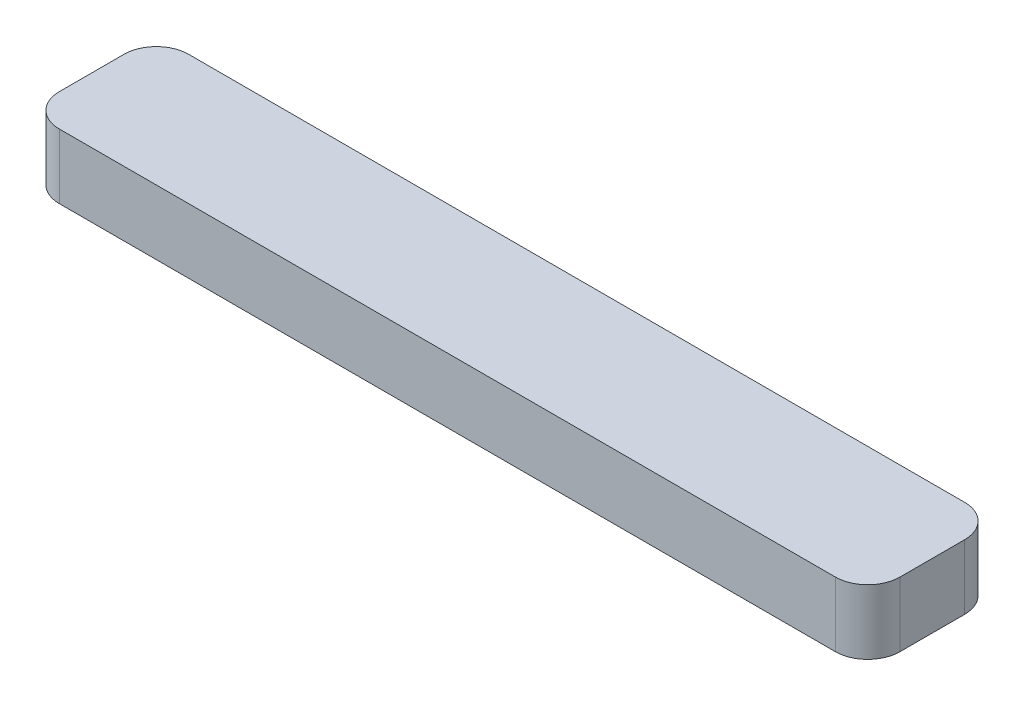
ISO-10303-21;
HEADER;
FILE_DESCRIPTION(('STEP AP214'),'2;1');
FILE_NAME('part.step','',(''),(''),'','','');
FILE_SCHEMA(('AUTOMOTIVE_DESIGN { 1 0 10303 214 1 1 1 1 }'));
ENDSEC;
DATA;
#1=APPLICATION_CONTEXT('core data for automotive mechanical design processes');
#2=APPLICATION_PROTOCOL_DEFINITION('international standard','automotive_design',2000,#1);
#3=PRODUCT_CONTEXT('',#1,'mechanical');
#4=PRODUCT('Part','Part','',(#3));
#5=PRODUCT_RELATED_PRODUCT_CATEGORY('part','',(#4));
#6=PRODUCT_DEFINITION_FORMATION('','',#4);
#7=PRODUCT_DEFINITION_CONTEXT('part definition',#1,'design');
#8=PRODUCT_DEFINITION('design','',#6,#7);
#9=PRODUCT_DEFINITION_SHAPE('','',#8);
#10=(LENGTH_UNIT() NAMED_UNIT(*) SI_UNIT(.MILLI.,.METRE.));
#11=(NAMED_UNIT(*) PLANE_ANGLE_UNIT() SI_UNIT($,.RADIAN.));
#12=(NAMED_UNIT(*) SI_UNIT($,.STERADIAN.) SOLID_ANGLE_UNIT());
#13=UNCERTAINTY_MEASURE_WITH_UNIT(LENGTH_MEASURE(1.E-05),#10,'distance_accuracy_value','');
#14=(GEOMETRIC_REPRESENTATION_CONTEXT(3) GLOBAL_UNCERTAINTY_ASSIGNED_CONTEXT((#13)) GLOBAL_UNIT_ASSIGNED_CONTEXT((#10,
#11,#12)) REPRESENTATION_CONTEXT('',''));
#15=CARTESIAN_POINT('',(0.,0.,0.));
#16=DIRECTION('',(0.,0.,1.));
#17=DIRECTION('',(1.,0.,0.));
#18=AXIS2_PLACEMENT_3D('',#15,#16,#17);
#19=CARTESIAN_POINT('',(6.,1.,0.5));
#20=DIRECTION('',(0.,-1.,0.));
#21=DIRECTION('',(0.,0.,-1.));
#22=AXIS2_PLACEMENT_3D('',#19,#20,#21);
#23=CYLINDRICAL_SURFACE('',#22,0.5);
#24=CARTESIAN_POINT('',(6.,0.,0.5));
#25=DIRECTION('',(0.,1.,0.));
#26=DIRECTION('',(0.,0.,1.));
#27=AXIS2_PLACEMENT_3D('',#24,#25,#26);
#28=CIRCLE('',#27,0.5);
#29=CARTESIAN_POINT('',(6.,0.,1.));
#30=VERTEX_POINT('',#29);
#31=CARTESIAN_POINT('',(6.5,0.,0.499999999999997));
#32=VERTEX_POINT('',#31);
#33=EDGE_CURVE('E146',#30,#32,#28,.T.);
#34=ORIENTED_EDGE('',*,*,#33,.T.);
#35=DIRECTION('',(0.,-1.,0.));
#36=VECTOR('',#35,1.);
#37=CARTESIAN_POINT('',(6.5,1.,0.499999999999997));
#38=LINE('',#37,#36);
#39=CARTESIAN_POINT('',(6.5,1.,0.499999999999997));
#40=VERTEX_POINT('',#39);
#41=EDGE_CURVE('E11',#40,#32,#38,.T.);
#42=ORIENTED_EDGE('',*,*,#41,.F.);
#43=CARTESIAN_POINT('',(6.,1.,0.5));
#44=DIRECTION('',(0.,1.,0.));
#45=DIRECTION('',(0.,0.,1.));
#46=AXIS2_PLACEMENT_3D('',#43,#44,#45);
#47=CIRCLE('',#46,0.5);
#48=CARTESIAN_POINT('',(6.,1.,1.));
#49=VERTEX_POINT('',#48);
#50=EDGE_CURVE('E168',#49,#40,#47,.T.);
#51=ORIENTED_EDGE('',*,*,#50,.F.);
#52=DIRECTION('',(0.,-1.,0.));
#53=VECTOR('',#52,1.);
#54=CARTESIAN_POINT('',(6.,1.,1.));
#55=LINE('',#54,#53);
#56=EDGE_CURVE('E142',#49,#30,#55,.T.);
#57=ORIENTED_EDGE('',*,*,#56,.T.);
#58=EDGE_LOOP('',(#34,#42,#51,#57));
#59=FACE_BOUND('',#58,.T.);
#60=ADVANCED_FACE('F45',(#59),#23,.T.);
#61=CARTESIAN_POINT('',(6.5,1.,-0.499999999999997));
#62=DIRECTION('',(-1.,0.,0.));
#63=DIRECTION('',(0.,0.,1.));
#64=AXIS2_PLACEMENT_3D('',#61,#62,#63);
#65=PLANE('',#64);
#66=DIRECTION('',(0.,0.,-1.));
#67=VECTOR('',#66,1.);
#68=CARTESIAN_POINT('',(6.5,0.,-0.499999999999997));
#69=LINE('',#68,#67);
#70=CARTESIAN_POINT('',(6.5,0.,-0.499999999999997));
#71=VERTEX_POINT('',#70);
#72=EDGE_CURVE('E150',#32,#71,#69,.T.);
#73=ORIENTED_EDGE('',*,*,#72,.T.);
#74=DIRECTION('',(0.,-1.,0.));
#75=VECTOR('',#74,1.);
#76=CARTESIAN_POINT('',(6.5,1.,-0.499999999999997));
#77=LINE('',#76,#75);
#78=CARTESIAN_POINT('',(6.5,1.,-0.499999999999997));
#79=VERTEX_POINT('',#78);
#80=EDGE_CURVE('E54',#79,#71,#77,.T.);
#81=ORIENTED_EDGE('',*,*,#80,.F.);
#82=DIRECTION('',(0.,0.,-1.));
#83=VECTOR('',#82,1.);
#84=CARTESIAN_POINT('',(6.5,1.,-0.499999999999997));
#85=LINE('',#84,#83);
#86=EDGE_CURVE('E105',#40,#79,#85,.T.);
#87=ORIENTED_EDGE('',*,*,#86,.F.);
#88=ORIENTED_EDGE('',*,*,#41,.T.);
#89=EDGE_LOOP('',(#73,#81,#87,#88));
#90=FACE_BOUND('',#89,.T.);
#91=ADVANCED_FACE('F214',(#90),#65,.F.);
#92=CARTESIAN_POINT('',(6.,1.,-0.5));
#93=DIRECTION('',(0.,-1.,0.));
#94=DIRECTION('',(0.,0.,-1.));
#95=AXIS2_PLACEMENT_3D('',#92,#93,#94);
#96=CYLINDRICAL_SURFACE('',#95,0.5);
#97=CARTESIAN_POINT('',(6.,0.,-0.5));
#98=DIRECTION('',(0.,1.,0.));
#99=DIRECTION('',(0.,0.,-1.));
#100=AXIS2_PLACEMENT_3D('',#97,#98,#99);
#101=CIRCLE('',#100,0.5);
#102=CARTESIAN_POINT('',(6.,0.,-1.));
#103=VERTEX_POINT('',#102);
#104=EDGE_CURVE('E153',#71,#103,#101,.T.);
#105=ORIENTED_EDGE('',*,*,#104,.T.);
#106=DIRECTION('',(0.,-1.,0.));
#107=VECTOR('',#106,1.);
#108=CARTESIAN_POINT('',(6.,1.,-1.));
#109=LINE('',#108,#107);
#110=CARTESIAN_POINT('',(6.,1.,-1.));
#111=VERTEX_POINT('',#110);
#112=EDGE_CURVE('E179',#111,#103,#109,.T.);
#113=ORIENTED_EDGE('',*,*,#112,.F.);
#114=CARTESIAN_POINT('',(6.,1.,-0.5));
#115=DIRECTION('',(0.,1.,0.));
#116=DIRECTION('',(0.,0.,-1.));
#117=AXIS2_PLACEMENT_3D('',#114,#115,#116);
#118=CIRCLE('',#117,0.5);
#119=EDGE_CURVE('E189',#79,#111,#118,.T.);
#120=ORIENTED_EDGE('',*,*,#119,.F.);
#121=ORIENTED_EDGE('',*,*,#80,.T.);
#122=EDGE_LOOP('',(#105,#113,#120,#121));
#123=FACE_BOUND('',#122,.T.);
#124=ADVANCED_FACE('F187',(#123),#96,.T.);
#125=CARTESIAN_POINT('',(-6.,1.,-1.));
#126=DIRECTION('',(0.,0.,1.));
#127=DIRECTION('',(1.,0.,0.));
#128=AXIS2_PLACEMENT_3D('',#125,#126,#127);
#129=PLANE('',#128);
#130=DIRECTION('',(-1.,0.,0.));
#131=VECTOR('',#130,1.);
#132=CARTESIAN_POINT('',(-6.,0.,-1.));
#133=LINE('',#132,#131);
#134=CARTESIAN_POINT('',(-6.,0.,-1.));
#135=VERTEX_POINT('',#134);
#136=EDGE_CURVE('E156',#103,#135,#133,.T.);
#137=ORIENTED_EDGE('',*,*,#136,.T.);
#138=DIRECTION('',(0.,-1.,0.));
#139=VECTOR('',#138,1.);
#140=CARTESIAN_POINT('',(-6.,1.,-1.));
#141=LINE('',#140,#139);
#142=CARTESIAN_POINT('',(-6.,1.,-1.));
#143=VERTEX_POINT('',#142);
#144=EDGE_CURVE('E175',#143,#135,#141,.T.);
#145=ORIENTED_EDGE('',*,*,#144,.F.);
#146=DIRECTION('',(-1.,0.,0.));
#147=VECTOR('',#146,1.);
#148=CARTESIAN_POINT('',(-6.,1.,-1.));
#149=LINE('',#148,#147);
#150=EDGE_CURVE('E202',#111,#143,#149,.T.);
#151=ORIENTED_EDGE('',*,*,#150,.F.);
#152=ORIENTED_EDGE('',*,*,#112,.T.);
#153=EDGE_LOOP('',(#137,#145,#151,#152));
#154=FACE_BOUND('',#153,.T.);
#155=ADVANCED_FACE('F197',(#154),#129,.F.);
#156=CARTESIAN_POINT('',(-6.,1.,-0.5));
#157=DIRECTION('',(0.,-1.,0.));
#158=DIRECTION('',(0.,0.,-1.));
#159=AXIS2_PLACEMENT_3D('',#156,#157,#158);
#160=CYLINDRICAL_SURFACE('',#159,0.5);
#161=CARTESIAN_POINT('',(-6.,0.,-0.5));
#162=DIRECTION('',(0.,1.,0.));
#163=DIRECTION('',(0.,0.,1.));
#164=AXIS2_PLACEMENT_3D('',#161,#162,#163);
#165=CIRCLE('',#164,0.5);
#166=CARTESIAN_POINT('',(-6.5,0.,-0.499999999999996));
#167=VERTEX_POINT('',#166);
#168=EDGE_CURVE('E159',#135,#167,#165,.T.);
#169=ORIENTED_EDGE('',*,*,#168,.T.);
#170=DIRECTION('',(0.,-1.,0.));
#171=VECTOR('',#170,1.);
#172=CARTESIAN_POINT('',(-6.5,1.,-0.499999999999996));
#173=LINE('',#172,#171);
#174=CARTESIAN_POINT('',(-6.5,1.,-0.499999999999996));
#175=VERTEX_POINT('',#174);
#176=EDGE_CURVE('E135',#175,#167,#173,.T.);
#177=ORIENTED_EDGE('',*,*,#176,.F.);
#178=CARTESIAN_POINT('',(-6.,1.,-0.5));
#179=DIRECTION('',(0.,1.,0.));
#180=DIRECTION('',(0.,0.,1.));
#181=AXIS2_PLACEMENT_3D('',#178,#179,#180);
#182=CIRCLE('',#181,0.5);
#183=EDGE_CURVE('E124',#143,#175,#182,.T.);
#184=ORIENTED_EDGE('',*,*,#183,.F.);
#185=ORIENTED_EDGE('',*,*,#144,.T.);
#186=EDGE_LOOP('',(#169,#177,#184,#185));
#187=FACE_BOUND('',#186,.T.);
#188=ADVANCED_FACE('F200',(#187),#160,.T.);
#189=CARTESIAN_POINT('',(-6.5,1.,-0.499999999999996));
#190=DIRECTION('',(1.,0.,0.));
#191=DIRECTION('',(0.,0.,-1.));
#192=AXIS2_PLACEMENT_3D('',#189,#190,#191);
#193=PLANE('',#192);
#194=DIRECTION('',(0.,0.,1.));
#195=VECTOR('',#194,1.);
#196=CARTESIAN_POINT('',(-6.5,0.,-0.499999999999996));
#197=LINE('',#196,#195);
#198=CARTESIAN_POINT('',(-6.5,0.,0.499999999999997));
#199=VERTEX_POINT('',#198);
#200=EDGE_CURVE('E133',#167,#199,#197,.T.);
#201=ORIENTED_EDGE('',*,*,#200,.T.);
#202=DIRECTION('',(0.,-1.,0.));
#203=VECTOR('',#202,1.);
#204=CARTESIAN_POINT('',(-6.5,1.,0.499999999999997));
#205=LINE('',#204,#203);
#206=CARTESIAN_POINT('',(-6.5,1.,0.499999999999997));
#207=VERTEX_POINT('',#206);
#208=EDGE_CURVE('E130',#207,#199,#205,.T.);
#209=ORIENTED_EDGE('',*,*,#208,.F.);
#210=DIRECTION('',(0.,0.,1.));
#211=VECTOR('',#210,1.);
#212=CARTESIAN_POINT('',(-6.5,1.,-0.499999999999996));
#213=LINE('',#212,#211);
#214=EDGE_CURVE('E118',#175,#207,#213,.T.);
#215=ORIENTED_EDGE('',*,*,#214,.F.);
#216=ORIENTED_EDGE('',*,*,#176,.T.);
#217=EDGE_LOOP('',(#201,#209,#215,#216));
#218=FACE_BOUND('',#217,.T.);
#219=ADVANCED_FACE('F131',(#218),#193,.F.);
#220=CARTESIAN_POINT('',(-6.,1.,0.5));
#221=DIRECTION('',(0.,-1.,0.));
#222=DIRECTION('',(0.,0.,-1.));
#223=AXIS2_PLACEMENT_3D('',#220,#221,#222);
#224=CYLINDRICAL_SURFACE('',#223,0.5);
#225=CARTESIAN_POINT('',(-6.,0.,0.5));
#226=DIRECTION('',(0.,1.,0.));
#227=DIRECTION('',(0.,0.,1.));
#228=AXIS2_PLACEMENT_3D('',#225,#226,#227);
#229=CIRCLE('',#228,0.5);
#230=CARTESIAN_POINT('',(-6.,0.,1.));
#231=VERTEX_POINT('',#230);
#232=EDGE_CURVE('E91',#199,#231,#229,.T.);
#233=ORIENTED_EDGE('',*,*,#232,.T.);
#234=DIRECTION('',(0.,-1.,0.));
#235=VECTOR('',#234,1.);
#236=CARTESIAN_POINT('',(-6.,1.,1.));
#237=LINE('',#236,#235);
#238=CARTESIAN_POINT('',(-6.,1.,1.));
#239=VERTEX_POINT('',#238);
#240=EDGE_CURVE('E136',#239,#231,#237,.T.);
#241=ORIENTED_EDGE('',*,*,#240,.F.);
#242=CARTESIAN_POINT('',(-6.,1.,0.5));
#243=DIRECTION('',(0.,1.,0.));
#244=DIRECTION('',(0.,0.,1.));
#245=AXIS2_PLACEMENT_3D('',#242,#243,#244);
#246=CIRCLE('',#245,0.5);
#247=EDGE_CURVE('E122',#207,#239,#246,.T.);
#248=ORIENTED_EDGE('',*,*,#247,.F.);
#249=ORIENTED_EDGE('',*,*,#208,.T.);
#250=EDGE_LOOP('',(#233,#241,#248,#249));
#251=FACE_BOUND('',#250,.T.);
#252=ADVANCED_FACE('F138',(#251),#224,.T.);
#253=CARTESIAN_POINT('',(-6.,1.,1.));
#254=DIRECTION('',(0.,0.,-1.));
#255=DIRECTION('',(-1.,0.,0.));
#256=AXIS2_PLACEMENT_3D('',#253,#254,#255);
#257=PLANE('',#256);
#258=DIRECTION('',(1.,0.,0.));
#259=VECTOR('',#258,1.);
#260=CARTESIAN_POINT('',(-6.,0.,1.));
#261=LINE('',#260,#259);
#262=EDGE_CURVE('E97',#231,#30,#261,.T.);
#263=ORIENTED_EDGE('',*,*,#262,.T.);
#264=ORIENTED_EDGE('',*,*,#56,.F.);
#265=DIRECTION('',(1.,0.,0.));
#266=VECTOR('',#265,1.);
#267=CARTESIAN_POINT('',(-6.,1.,1.));
#268=LINE('',#267,#266);
#269=EDGE_CURVE('E62',#239,#49,#268,.T.);
#270=ORIENTED_EDGE('',*,*,#269,.F.);
#271=ORIENTED_EDGE('',*,*,#240,.T.);
#272=EDGE_LOOP('',(#263,#264,#270,#271));
#273=FACE_BOUND('',#272,.T.);
#274=ADVANCED_FACE('F230',(#273),#257,.F.);
#275=CARTESIAN_POINT('',(6.,1.,0.5));
#276=DIRECTION('',(0.,1.,0.));
#277=DIRECTION('',(0.,0.,1.));
#278=AXIS2_PLACEMENT_3D('',#275,#276,#277);
#279=PLANE('',#278);
#280=ORIENTED_EDGE('',*,*,#50,.T.);
#281=ORIENTED_EDGE('',*,*,#86,.T.);
#282=ORIENTED_EDGE('',*,*,#119,.T.);
#283=ORIENTED_EDGE('',*,*,#150,.T.);
#284=ORIENTED_EDGE('',*,*,#183,.T.);
#285=ORIENTED_EDGE('',*,*,#214,.T.);
#286=ORIENTED_EDGE('',*,*,#247,.T.);
#287=ORIENTED_EDGE('',*,*,#269,.T.);
#288=EDGE_LOOP('',(#280,#281,#282,#283,#284,#285,#286,#287));
#289=FACE_BOUND('',#288,.T.);
#290=ADVANCED_FACE('F120',(#289),#279,.T.);
#291=CARTESIAN_POINT('',(6.,0.,0.5));
#292=DIRECTION('',(0.,1.,0.));
#293=DIRECTION('',(0.,0.,1.));
#294=AXIS2_PLACEMENT_3D('',#291,#292,#293);
#295=PLANE('',#294);
#296=ORIENTED_EDGE('',*,*,#33,.F.);
#297=ORIENTED_EDGE('',*,*,#262,.F.);
#298=ORIENTED_EDGE('',*,*,#232,.F.);
#299=ORIENTED_EDGE('',*,*,#200,.F.);
#300=ORIENTED_EDGE('',*,*,#168,.F.);
#301=ORIENTED_EDGE('',*,*,#136,.F.);
#302=ORIENTED_EDGE('',*,*,#104,.F.);
#303=ORIENTED_EDGE('',*,*,#72,.F.);
#304=EDGE_LOOP('',(#296,#297,#298,#299,#300,#301,#302,#303));
#305=FACE_BOUND('',#304,.T.);
#306=ADVANCED_FACE('F193',(#305),#295,.F.);
#307=CLOSED_SHELL('',(#60,#91,#124,#155,#188,#219,#252,#274,#290,#306));
#308=MANIFOLD_SOLID_BREP('B2',#307);
#309=ADVANCED_BREP_SHAPE_REPRESENTATION('',(#18,#308),#14);
#310=SHAPE_DEFINITION_REPRESENTATION(#9,#309);
ENDSEC;
END-ISO-10303-21;
